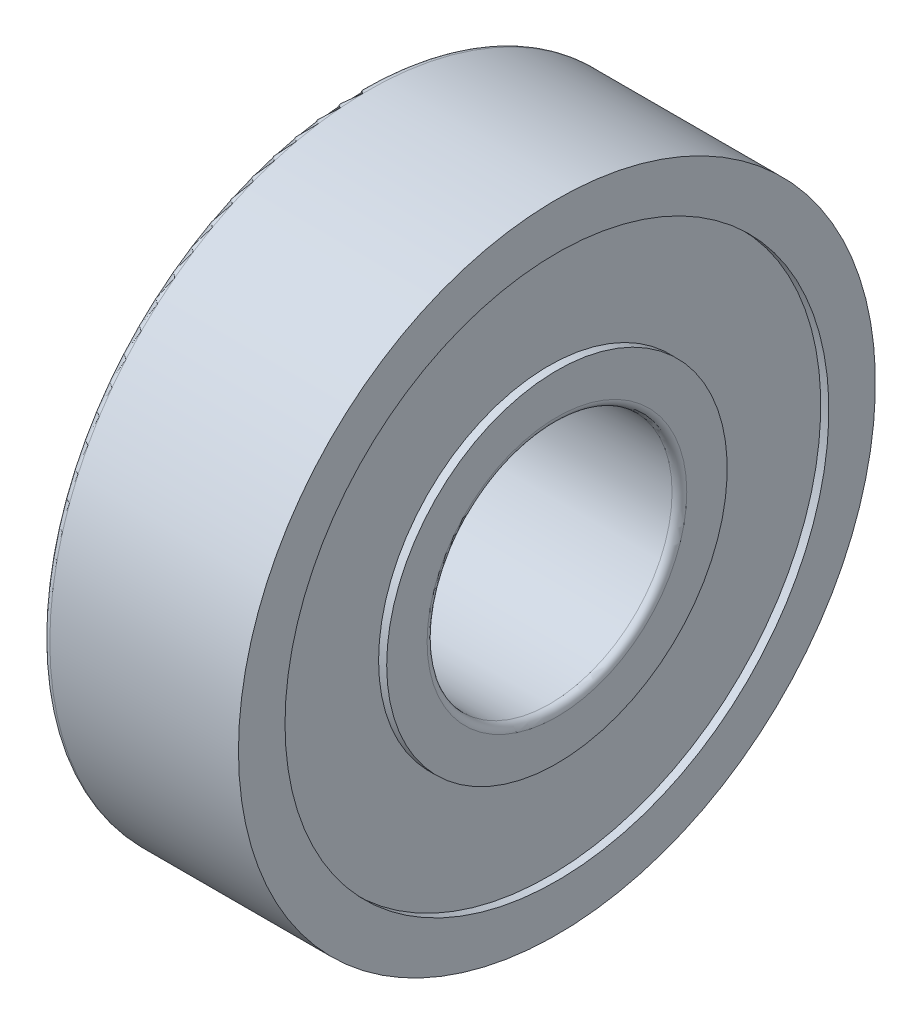
ISO-10303-21;
HEADER;
FILE_DESCRIPTION(('STEP AP214'),'2;1');
FILE_NAME('part.step','',(''),(''),'','','');
FILE_SCHEMA(('AUTOMOTIVE_DESIGN { 1 0 10303 214 1 1 1 1 }'));
ENDSEC;
DATA;
#1=APPLICATION_CONTEXT('core data for automotive mechanical design processes');
#2=APPLICATION_PROTOCOL_DEFINITION('international standard','automotive_design',2000,#1);
#3=PRODUCT_CONTEXT('',#1,'mechanical');
#4=PRODUCT('Part','Part','',(#3));
#5=PRODUCT_RELATED_PRODUCT_CATEGORY('part','',(#4));
#6=PRODUCT_DEFINITION_FORMATION('','',#4);
#7=PRODUCT_DEFINITION_CONTEXT('part definition',#1,'design');
#8=PRODUCT_DEFINITION('design','',#6,#7);
#9=PRODUCT_DEFINITION_SHAPE('','',#8);
#10=(LENGTH_UNIT() NAMED_UNIT(*) SI_UNIT(.MILLI.,.METRE.));
#11=(NAMED_UNIT(*) PLANE_ANGLE_UNIT() SI_UNIT($,.RADIAN.));
#12=(NAMED_UNIT(*) SI_UNIT($,.STERADIAN.) SOLID_ANGLE_UNIT());
#13=UNCERTAINTY_MEASURE_WITH_UNIT(LENGTH_MEASURE(1.E-05),#10,'distance_accuracy_value','');
#14=(GEOMETRIC_REPRESENTATION_CONTEXT(3) GLOBAL_UNCERTAINTY_ASSIGNED_CONTEXT((#13)) GLOBAL_UNIT_ASSIGNED_CONTEXT((#10,
#11,#12)) REPRESENTATION_CONTEXT('',''));
#15=CARTESIAN_POINT('',(0.,0.,0.));
#16=DIRECTION('',(0.,0.,1.));
#17=DIRECTION('',(1.,0.,0.));
#18=AXIS2_PLACEMENT_3D('',#15,#16,#17);
#19=CARTESIAN_POINT('',(6.3,0.,0.));
#20=DIRECTION('',(1.,0.,0.));
#21=DIRECTION('',(0.,0.,1.));
#22=AXIS2_PLACEMENT_3D('',#19,#20,#21);
#23=TOROIDAL_SURFACE('',#22,5.3,0.3);
#24=CARTESIAN_POINT('',(6.3,0.,0.));
#25=DIRECTION('',(-1.,0.,0.));
#26=DIRECTION('',(0.,0.,1.));
#27=AXIS2_PLACEMENT_3D('',#24,#25,#26);
#28=CIRCLE('',#27,5.);
#29=CARTESIAN_POINT('',(6.3,0.,5.));
#30=VERTEX_POINT('',#29);
#31=EDGE_CURVE('E275',#30,#30,#28,.F.);
#32=ORIENTED_EDGE('',*,*,#31,.T.);
#33=EDGE_LOOP('',(#32));
#34=FACE_BOUND('',#33,.T.);
#35=CARTESIAN_POINT('',(6.,0.,0.));
#36=DIRECTION('',(-1.,0.,0.));
#37=DIRECTION('',(0.,0.,-1.));
#38=AXIS2_PLACEMENT_3D('',#35,#36,#37);
#39=CIRCLE('',#38,5.3);
#40=CARTESIAN_POINT('',(6.,-5.3,0.));
#41=VERTEX_POINT('',#40);
#42=CARTESIAN_POINT('',(6.,0.,-5.3));
#43=VERTEX_POINT('',#42);
#44=EDGE_CURVE('E66',#41,#43,#39,.F.);
#45=ORIENTED_EDGE('',*,*,#44,.F.);
#46=CARTESIAN_POINT('',(6.,0.,0.));
#47=DIRECTION('',(-1.,0.,0.));
#48=DIRECTION('',(0.,-1.,0.));
#49=AXIS2_PLACEMENT_3D('',#46,#47,#48);
#50=CIRCLE('',#49,5.3);
#51=CARTESIAN_POINT('',(6.,0.,5.3));
#52=VERTEX_POINT('',#51);
#53=EDGE_CURVE('E64',#52,#41,#50,.F.);
#54=ORIENTED_EDGE('',*,*,#53,.F.);
#55=CARTESIAN_POINT('',(6.,0.,0.));
#56=DIRECTION('',(-1.,0.,0.));
#57=DIRECTION('',(0.,0.,1.));
#58=AXIS2_PLACEMENT_3D('',#55,#56,#57);
#59=CIRCLE('',#58,5.3);
#60=EDGE_CURVE('E61',#43,#52,#59,.F.);
#61=ORIENTED_EDGE('',*,*,#60,.F.);
#62=EDGE_LOOP('',(#45,#54,#61));
#63=FACE_BOUND('',#62,.T.);
#64=ADVANCED_FACE('F16',(#34,#63),#23,.T.);
#65=CARTESIAN_POINT('',(10.,0.,0.));
#66=DIRECTION('',(-1.,0.,0.));
#67=DIRECTION('',(0.,0.,1.));
#68=AXIS2_PLACEMENT_3D('',#65,#66,#67);
#69=CYLINDRICAL_SURFACE('',#68,5.);
#70=CARTESIAN_POINT('',(13.7,0.,0.));
#71=DIRECTION('',(1.,0.,0.));
#72=DIRECTION('',(0.,0.,1.));
#73=AXIS2_PLACEMENT_3D('',#70,#71,#72);
#74=CIRCLE('',#73,5.);
#75=CARTESIAN_POINT('',(13.7,0.,5.));
#76=VERTEX_POINT('',#75);
#77=EDGE_CURVE('E70',#76,#76,#74,.F.);
#78=ORIENTED_EDGE('',*,*,#77,.F.);
#79=EDGE_LOOP('',(#78));
#80=FACE_BOUND('',#79,.T.);
#81=ORIENTED_EDGE('',*,*,#31,.F.);
#82=EDGE_LOOP('',(#81));
#83=FACE_BOUND('',#82,.T.);
#84=ADVANCED_FACE('F93',(#80,#83),#69,.F.);
#85=CARTESIAN_POINT('',(6.,-6.125,0.));
#86=DIRECTION('',(-1.,0.,0.));
#87=DIRECTION('',(0.,0.,1.));
#88=AXIS2_PLACEMENT_3D('',#85,#86,#87);
#89=PLANE('',#88);
#90=ORIENTED_EDGE('',*,*,#60,.T.);
#91=ORIENTED_EDGE('',*,*,#53,.T.);
#92=ORIENTED_EDGE('',*,*,#44,.T.);
#93=EDGE_LOOP('',(#90,#91,#92));
#94=FACE_BOUND('',#93,.T.);
#95=CARTESIAN_POINT('',(6.,0.,0.));
#96=DIRECTION('',(-1.,0.,0.));
#97=DIRECTION('',(0.,0.,1.));
#98=AXIS2_PLACEMENT_3D('',#95,#96,#97);
#99=CIRCLE('',#98,6.95);
#100=CARTESIAN_POINT('',(6.,0.,6.95));
#101=VERTEX_POINT('',#100);
#102=EDGE_CURVE('E108',#101,#101,#99,.F.);
#103=ORIENTED_EDGE('',*,*,#102,.F.);
#104=EDGE_LOOP('',(#103));
#105=FACE_BOUND('',#104,.T.);
#106=ADVANCED_FACE('F73',(#94,#105),#89,.T.);
#107=CARTESIAN_POINT('',(13.7,0.,0.));
#108=DIRECTION('',(1.,0.,0.));
#109=DIRECTION('',(0.,0.,1.));
#110=AXIS2_PLACEMENT_3D('',#107,#108,#109);
#111=TOROIDAL_SURFACE('',#110,5.3,0.3);
#112=ORIENTED_EDGE('',*,*,#77,.T.);
#113=EDGE_LOOP('',(#112));
#114=FACE_BOUND('',#113,.T.);
#115=CARTESIAN_POINT('',(14.,0.,0.));
#116=DIRECTION('',(1.,0.,0.));
#117=DIRECTION('',(0.,0.,-1.));
#118=AXIS2_PLACEMENT_3D('',#115,#116,#117);
#119=CIRCLE('',#118,5.3);
#120=CARTESIAN_POINT('',(14.,0.,5.3));
#121=VERTEX_POINT('',#120);
#122=CARTESIAN_POINT('',(14.,0.,-5.3));
#123=VERTEX_POINT('',#122);
#124=EDGE_CURVE('E232',#121,#123,#119,.F.);
#125=ORIENTED_EDGE('',*,*,#124,.F.);
#126=CARTESIAN_POINT('',(14.,0.,0.));
#127=DIRECTION('',(1.,0.,0.));
#128=DIRECTION('',(0.,0.,1.));
#129=AXIS2_PLACEMENT_3D('',#126,#127,#128);
#130=CIRCLE('',#129,5.3);
#131=CARTESIAN_POINT('',(14.,-5.3,0.));
#132=VERTEX_POINT('',#131);
#133=EDGE_CURVE('E118',#132,#121,#130,.F.);
#134=ORIENTED_EDGE('',*,*,#133,.F.);
#135=CARTESIAN_POINT('',(14.,0.,0.));
#136=DIRECTION('',(1.,0.,0.));
#137=DIRECTION('',(0.,-1.,0.));
#138=AXIS2_PLACEMENT_3D('',#135,#136,#137);
#139=CIRCLE('',#138,5.3);
#140=EDGE_CURVE('E113',#123,#132,#139,.F.);
#141=ORIENTED_EDGE('',*,*,#140,.F.);
#142=EDGE_LOOP('',(#125,#134,#141));
#143=FACE_BOUND('',#142,.T.);
#144=ADVANCED_FACE('F92',(#114,#143),#111,.T.);
#145=CARTESIAN_POINT('',(6.1655,0.,0.));
#146=DIRECTION('',(-1.,0.,0.));
#147=DIRECTION('',(0.,0.,1.));
#148=AXIS2_PLACEMENT_3D('',#145,#146,#147);
#149=CYLINDRICAL_SURFACE('',#148,6.95);
#150=CARTESIAN_POINT('',(6.331,0.,0.));
#151=DIRECTION('',(-1.,0.,0.));
#152=DIRECTION('',(0.,0.,1.));
#153=AXIS2_PLACEMENT_3D('',#150,#151,#152);
#154=CIRCLE('',#153,6.95);
#155=CARTESIAN_POINT('',(6.331,0.,6.95));
#156=VERTEX_POINT('',#155);
#157=EDGE_CURVE('E121',#156,#156,#154,.F.);
#158=ORIENTED_EDGE('',*,*,#157,.F.);
#159=EDGE_LOOP('',(#158));
#160=FACE_BOUND('',#159,.T.);
#161=ORIENTED_EDGE('',*,*,#102,.T.);
#162=EDGE_LOOP('',(#161));
#163=FACE_BOUND('',#162,.T.);
#164=ADVANCED_FACE('F218',(#160,#163),#149,.T.);
#165=CARTESIAN_POINT('',(14.,-6.125,0.));
#166=DIRECTION('',(1.,0.,0.));
#167=DIRECTION('',(0.,0.,-1.));
#168=AXIS2_PLACEMENT_3D('',#165,#166,#167);
#169=PLANE('',#168);
#170=CARTESIAN_POINT('',(14.,0.,0.));
#171=DIRECTION('',(-1.,0.,0.));
#172=DIRECTION('',(0.,0.,1.));
#173=AXIS2_PLACEMENT_3D('',#170,#171,#172);
#174=CIRCLE('',#173,6.95);
#175=CARTESIAN_POINT('',(14.,0.,6.95));
#176=VERTEX_POINT('',#175);
#177=EDGE_CURVE('E254',#176,#176,#174,.T.);
#178=ORIENTED_EDGE('',*,*,#177,.F.);
#179=EDGE_LOOP('',(#178));
#180=FACE_BOUND('',#179,.T.);
#181=ORIENTED_EDGE('',*,*,#133,.T.);
#182=ORIENTED_EDGE('',*,*,#124,.T.);
#183=ORIENTED_EDGE('',*,*,#140,.T.);
#184=EDGE_LOOP('',(#181,#182,#183));
#185=FACE_BOUND('',#184,.T.);
#186=ADVANCED_FACE('F208',(#180,#185),#169,.T.);
#187=CARTESIAN_POINT('',(6.331,-9.025,0.));
#188=DIRECTION('',(-1.,0.,0.));
#189=DIRECTION('',(0.,0.,1.));
#190=AXIS2_PLACEMENT_3D('',#187,#188,#189);
#191=PLANE('',#190);
#192=ORIENTED_EDGE('',*,*,#157,.T.);
#193=EDGE_LOOP('',(#192));
#194=FACE_BOUND('',#193,.T.);
#195=CARTESIAN_POINT('',(6.331,0.,0.));
#196=DIRECTION('',(-1.,0.,0.));
#197=DIRECTION('',(0.,0.,1.));
#198=AXIS2_PLACEMENT_3D('',#195,#196,#197);
#199=CIRCLE('',#198,11.1);
#200=CARTESIAN_POINT('',(6.331,0.,11.1));
#201=VERTEX_POINT('',#200);
#202=EDGE_CURVE('E258',#201,#201,#199,.T.);
#203=ORIENTED_EDGE('',*,*,#202,.T.);
#204=EDGE_LOOP('',(#203));
#205=FACE_BOUND('',#204,.T.);
#206=ADVANCED_FACE('F217',(#194,#205),#191,.T.);
#207=CARTESIAN_POINT('',(13.8345,0.,0.));
#208=DIRECTION('',(-1.,0.,0.));
#209=DIRECTION('',(0.,0.,1.));
#210=AXIS2_PLACEMENT_3D('',#207,#208,#209);
#211=CYLINDRICAL_SURFACE('',#210,6.95);
#212=ORIENTED_EDGE('',*,*,#177,.T.);
#213=EDGE_LOOP('',(#212));
#214=FACE_BOUND('',#213,.T.);
#215=CARTESIAN_POINT('',(13.669,0.,0.));
#216=DIRECTION('',(-1.,0.,0.));
#217=DIRECTION('',(0.,0.,1.));
#218=AXIS2_PLACEMENT_3D('',#215,#216,#217);
#219=CIRCLE('',#218,6.95);
#220=CARTESIAN_POINT('',(13.669,0.,6.95));
#221=VERTEX_POINT('',#220);
#222=EDGE_CURVE('E262',#221,#221,#219,.T.);
#223=ORIENTED_EDGE('',*,*,#222,.F.);
#224=EDGE_LOOP('',(#223));
#225=FACE_BOUND('',#224,.T.);
#226=ADVANCED_FACE('F325',(#214,#225),#211,.T.);
#227=CARTESIAN_POINT('',(6.1655,0.,0.));
#228=DIRECTION('',(-1.,0.,0.));
#229=DIRECTION('',(0.,0.,1.));
#230=AXIS2_PLACEMENT_3D('',#227,#228,#229);
#231=CYLINDRICAL_SURFACE('',#230,11.1);
#232=CARTESIAN_POINT('',(6.,0.,0.));
#233=DIRECTION('',(-1.,0.,0.));
#234=DIRECTION('',(0.,0.,1.));
#235=AXIS2_PLACEMENT_3D('',#232,#233,#234);
#236=CIRCLE('',#235,11.1);
#237=CARTESIAN_POINT('',(6.,0.,11.1));
#238=VERTEX_POINT('',#237);
#239=EDGE_CURVE('E267',#238,#238,#236,.F.);
#240=ORIENTED_EDGE('',*,*,#239,.F.);
#241=EDGE_LOOP('',(#240));
#242=FACE_BOUND('',#241,.T.);
#243=ORIENTED_EDGE('',*,*,#202,.F.);
#244=EDGE_LOOP('',(#243));
#245=FACE_BOUND('',#244,.T.);
#246=ADVANCED_FACE('F322',(#242,#245),#231,.F.);
#247=CARTESIAN_POINT('',(13.669,-9.025,0.));
#248=DIRECTION('',(1.,0.,0.));
#249=DIRECTION('',(0.,0.,-1.));
#250=AXIS2_PLACEMENT_3D('',#247,#248,#249);
#251=PLANE('',#250);
#252=CARTESIAN_POINT('',(13.669,0.,0.));
#253=DIRECTION('',(-1.,0.,0.));
#254=DIRECTION('',(0.,0.,1.));
#255=AXIS2_PLACEMENT_3D('',#252,#253,#254);
#256=CIRCLE('',#255,11.1);
#257=CARTESIAN_POINT('',(13.669,0.,11.1));
#258=VERTEX_POINT('',#257);
#259=EDGE_CURVE('E270',#258,#258,#256,.F.);
#260=ORIENTED_EDGE('',*,*,#259,.T.);
#261=EDGE_LOOP('',(#260));
#262=FACE_BOUND('',#261,.T.);
#263=ORIENTED_EDGE('',*,*,#222,.T.);
#264=EDGE_LOOP('',(#263));
#265=FACE_BOUND('',#264,.T.);
#266=ADVANCED_FACE('F168',(#262,#265),#251,.T.);
#267=CARTESIAN_POINT('',(6.,-11.9,0.));
#268=DIRECTION('',(-1.,0.,0.));
#269=DIRECTION('',(0.,0.,1.));
#270=AXIS2_PLACEMENT_3D('',#267,#268,#269);
#271=PLANE('',#270);
#272=ORIENTED_EDGE('',*,*,#239,.T.);
#273=EDGE_LOOP('',(#272));
#274=FACE_BOUND('',#273,.T.);
#275=CARTESIAN_POINT('',(6.,0.,0.));
#276=DIRECTION('',(1.,0.,0.));
#277=DIRECTION('',(0.,0.,1.));
#278=AXIS2_PLACEMENT_3D('',#275,#276,#277);
#279=CIRCLE('',#278,12.7);
#280=CARTESIAN_POINT('',(6.,0.,12.7));
#281=VERTEX_POINT('',#280);
#282=CARTESIAN_POINT('',(6.,-12.7,0.));
#283=VERTEX_POINT('',#282);
#284=EDGE_CURVE('E124',#281,#283,#279,.T.);
#285=ORIENTED_EDGE('',*,*,#284,.F.);
#286=CARTESIAN_POINT('',(6.,0.,0.));
#287=DIRECTION('',(1.,0.,0.));
#288=DIRECTION('',(0.,0.,-1.));
#289=AXIS2_PLACEMENT_3D('',#286,#287,#288);
#290=CIRCLE('',#289,12.7);
#291=CARTESIAN_POINT('',(6.,0.,-12.7));
#292=VERTEX_POINT('',#291);
#293=EDGE_CURVE('E182',#292,#281,#290,.T.);
#294=ORIENTED_EDGE('',*,*,#293,.F.);
#295=CARTESIAN_POINT('',(6.,0.,0.));
#296=DIRECTION('',(1.,0.,0.));
#297=DIRECTION('',(0.,-1.,0.));
#298=AXIS2_PLACEMENT_3D('',#295,#296,#297);
#299=CIRCLE('',#298,12.7);
#300=EDGE_CURVE('E37',#283,#292,#299,.T.);
#301=ORIENTED_EDGE('',*,*,#300,.F.);
#302=EDGE_LOOP('',(#285,#294,#301));
#303=FACE_BOUND('',#302,.T.);
#304=ADVANCED_FACE('F159',(#274,#303),#271,.T.);
#305=CARTESIAN_POINT('',(13.8345,0.,0.));
#306=DIRECTION('',(-1.,0.,0.));
#307=DIRECTION('',(0.,0.,1.));
#308=AXIS2_PLACEMENT_3D('',#305,#306,#307);
#309=CYLINDRICAL_SURFACE('',#308,11.1);
#310=ORIENTED_EDGE('',*,*,#259,.F.);
#311=EDGE_LOOP('',(#310));
#312=FACE_BOUND('',#311,.T.);
#313=CARTESIAN_POINT('',(14.,0.,0.));
#314=DIRECTION('',(-1.,0.,0.));
#315=DIRECTION('',(0.,0.,1.));
#316=AXIS2_PLACEMENT_3D('',#313,#314,#315);
#317=CIRCLE('',#316,11.1);
#318=CARTESIAN_POINT('',(14.,0.,11.1));
#319=VERTEX_POINT('',#318);
#320=EDGE_CURVE('E152',#319,#319,#317,.T.);
#321=ORIENTED_EDGE('',*,*,#320,.F.);
#322=EDGE_LOOP('',(#321));
#323=FACE_BOUND('',#322,.T.);
#324=ADVANCED_FACE('F141',(#312,#323),#309,.F.);
#325=CARTESIAN_POINT('',(6.3,0.,0.));
#326=DIRECTION('',(1.,0.,0.));
#327=DIRECTION('',(0.,0.,1.));
#328=AXIS2_PLACEMENT_3D('',#325,#326,#327);
#329=TOROIDAL_SURFACE('',#328,12.7,0.300000000000001);
#330=CARTESIAN_POINT('',(6.3,0.,0.));
#331=DIRECTION('',(-1.,0.,0.));
#332=DIRECTION('',(0.,0.,1.));
#333=AXIS2_PLACEMENT_3D('',#330,#331,#332);
#334=CIRCLE('',#333,13.);
#335=CARTESIAN_POINT('',(6.3,0.,13.));
#336=VERTEX_POINT('',#335);
#337=EDGE_CURVE('E28',#336,#336,#334,.F.);
#338=ORIENTED_EDGE('',*,*,#337,.F.);
#339=EDGE_LOOP('',(#338));
#340=FACE_BOUND('',#339,.T.);
#341=ORIENTED_EDGE('',*,*,#293,.T.);
#342=ORIENTED_EDGE('',*,*,#284,.T.);
#343=ORIENTED_EDGE('',*,*,#300,.T.);
#344=EDGE_LOOP('',(#341,#342,#343));
#345=FACE_BOUND('',#344,.T.);
#346=ADVANCED_FACE('F129',(#340,#345),#329,.T.);
#347=CARTESIAN_POINT('',(14.,-12.05,0.));
#348=DIRECTION('',(1.,0.,0.));
#349=DIRECTION('',(0.,0.,-1.));
#350=AXIS2_PLACEMENT_3D('',#347,#348,#349);
#351=PLANE('',#350);
#352=CARTESIAN_POINT('',(14.,0.,0.));
#353=DIRECTION('',(-1.,0.,0.));
#354=DIRECTION('',(0.,0.,1.));
#355=AXIS2_PLACEMENT_3D('',#352,#353,#354);
#356=CIRCLE('',#355,13.);
#357=CARTESIAN_POINT('',(14.,0.,13.));
#358=VERTEX_POINT('',#357);
#359=EDGE_CURVE('E10',#358,#358,#356,.T.);
#360=ORIENTED_EDGE('',*,*,#359,.F.);
#361=EDGE_LOOP('',(#360));
#362=FACE_BOUND('',#361,.T.);
#363=ORIENTED_EDGE('',*,*,#320,.T.);
#364=EDGE_LOOP('',(#363));
#365=FACE_BOUND('',#364,.T.);
#366=ADVANCED_FACE('F140',(#362,#365),#351,.T.);
#367=CARTESIAN_POINT('',(10.15,0.,0.));
#368=DIRECTION('',(-1.,0.,0.));
#369=DIRECTION('',(0.,0.,1.));
#370=AXIS2_PLACEMENT_3D('',#367,#368,#369);
#371=CYLINDRICAL_SURFACE('',#370,13.);
#372=ORIENTED_EDGE('',*,*,#337,.T.);
#373=EDGE_LOOP('',(#372));
#374=FACE_BOUND('',#373,.T.);
#375=ORIENTED_EDGE('',*,*,#359,.T.);
#376=EDGE_LOOP('',(#375));
#377=FACE_BOUND('',#376,.T.);
#378=ADVANCED_FACE('F301',(#374,#377),#371,.T.);
#379=CLOSED_SHELL('',(#64,#84,#106,#144,#164,#186,#206,#226,#246,#266,#304,#324,#346,#366,#378));
#380=MANIFOLD_SOLID_BREP('B1',#379);
#381=ADVANCED_BREP_SHAPE_REPRESENTATION('',(#18,#380),#14);
#382=SHAPE_DEFINITION_REPRESENTATION(#9,#381);
ENDSEC;
END-ISO-10303-21;
